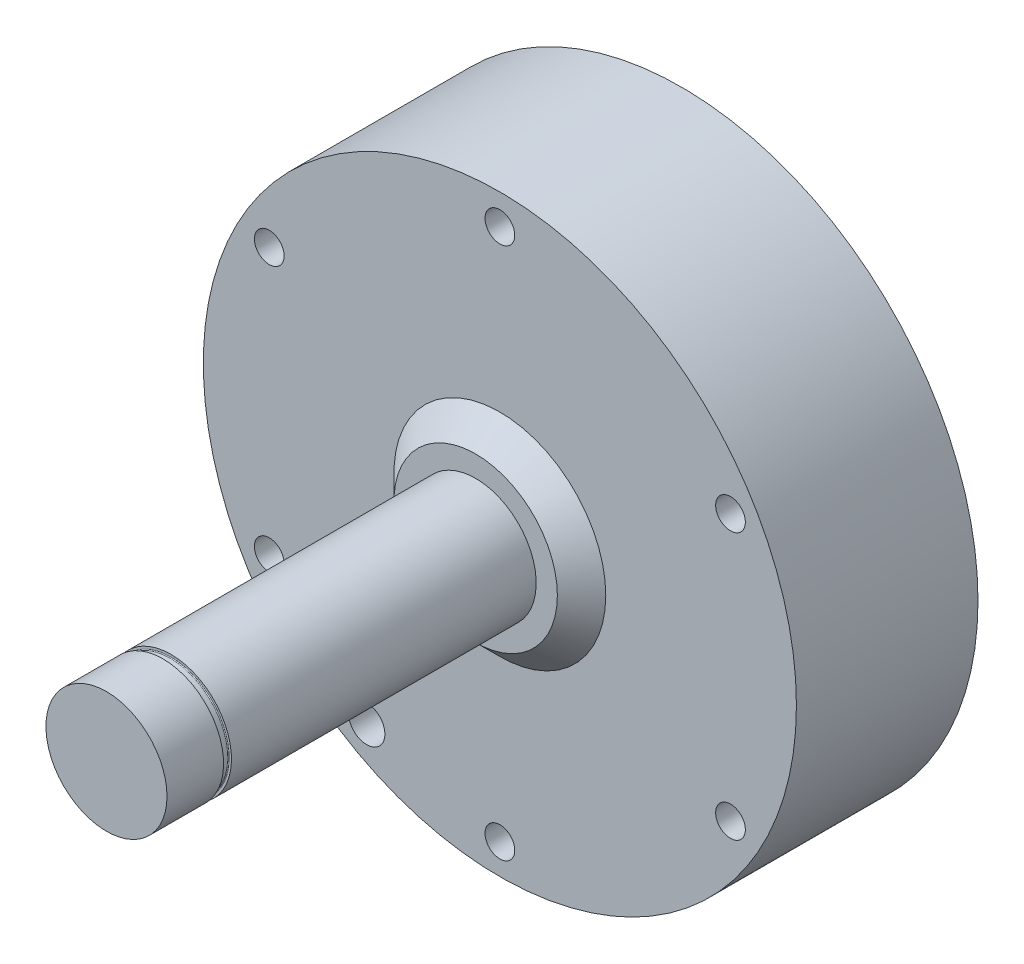
ISO-10303-21;
HEADER;
FILE_DESCRIPTION(('STEP AP214'),'2;1');
FILE_NAME('part.step','',(''),(''),'','','');
FILE_SCHEMA(('AUTOMOTIVE_DESIGN { 1 0 10303 214 1 1 1 1 }'));
ENDSEC;
DATA;
#1=APPLICATION_CONTEXT('core data for automotive mechanical design processes');
#2=APPLICATION_PROTOCOL_DEFINITION('international standard','automotive_design',2000,#1);
#3=PRODUCT_CONTEXT('',#1,'mechanical');
#4=PRODUCT('Part','Part','',(#3));
#5=PRODUCT_RELATED_PRODUCT_CATEGORY('part','',(#4));
#6=PRODUCT_DEFINITION_FORMATION('','',#4);
#7=PRODUCT_DEFINITION_CONTEXT('part definition',#1,'design');
#8=PRODUCT_DEFINITION('design','',#6,#7);
#9=PRODUCT_DEFINITION_SHAPE('','',#8);
#10=(LENGTH_UNIT() NAMED_UNIT(*) SI_UNIT(.MILLI.,.METRE.));
#11=(NAMED_UNIT(*) PLANE_ANGLE_UNIT() SI_UNIT($,.RADIAN.));
#12=(NAMED_UNIT(*) SI_UNIT($,.STERADIAN.) SOLID_ANGLE_UNIT());
#13=UNCERTAINTY_MEASURE_WITH_UNIT(LENGTH_MEASURE(1.E-05),#10,'distance_accuracy_value','');
#14=(GEOMETRIC_REPRESENTATION_CONTEXT(3) GLOBAL_UNCERTAINTY_ASSIGNED_CONTEXT((#13)) GLOBAL_UNIT_ASSIGNED_CONTEXT((#10,
#11,#12)) REPRESENTATION_CONTEXT('',''));
#15=CARTESIAN_POINT('',(0.,0.,0.));
#16=DIRECTION('',(0.,0.,1.));
#17=DIRECTION('',(1.,0.,0.));
#18=AXIS2_PLACEMENT_3D('',#15,#16,#17);
#19=CARTESIAN_POINT('',(0.,0.,95.));
#20=DIRECTION('',(0.,0.,-1.));
#21=DIRECTION('',(-1.,0.,0.));
#22=AXIS2_PLACEMENT_3D('',#19,#20,#21);
#23=CYLINDRICAL_SURFACE('',#22,10.);
#24=CARTESIAN_POINT('',(0.,0.,34.));
#25=DIRECTION('',(0.,0.,-1.));
#26=DIRECTION('',(-1.,0.,0.));
#27=AXIS2_PLACEMENT_3D('',#24,#25,#26);
#28=CIRCLE('',#27,10.);
#29=CARTESIAN_POINT('',(-10.,0.,34.));
#30=VERTEX_POINT('',#29);
#31=EDGE_CURVE('E11',#30,#30,#28,.F.);
#32=ORIENTED_EDGE('',*,*,#31,.T.);
#33=EDGE_LOOP('',(#32));
#34=FACE_BOUND('',#33,.T.);
#35=CARTESIAN_POINT('',(0.,0.,84.35));
#36=DIRECTION('',(0.,0.,-1.));
#37=DIRECTION('',(0.,1.,0.));
#38=AXIS2_PLACEMENT_3D('',#35,#36,#37);
#39=CIRCLE('',#38,10.);
#40=CARTESIAN_POINT('',(0.,10.,84.35));
#41=VERTEX_POINT('',#40);
#42=EDGE_CURVE('E101',#41,#41,#39,.T.);
#43=ORIENTED_EDGE('',*,*,#42,.T.);
#44=EDGE_LOOP('',(#43));
#45=FACE_BOUND('',#44,.T.);
#46=ADVANCED_FACE('F47',(#34,#45),#23,.T.);
#47=CARTESIAN_POINT('',(0.,0.,30.));
#48=DIRECTION('',(0.,0.,1.));
#49=DIRECTION('',(1.,0.,0.));
#50=AXIS2_PLACEMENT_3D('',#47,#48,#49);
#51=PLANE('',#50);
#52=CARTESIAN_POINT('',(38.1051177665155,21.9999999999996,30.));
#53=DIRECTION('',(0.,0.,1.));
#54=DIRECTION('',(1.,0.,0.));
#55=AXIS2_PLACEMENT_3D('',#52,#53,#54);
#56=CIRCLE('',#55,2.455);
#57=CARTESIAN_POINT('',(40.5601177665155,21.9999999999996,30.));
#58=VERTEX_POINT('',#57);
#59=EDGE_CURVE('E140',#58,#58,#56,.T.);
#60=ORIENTED_EDGE('',*,*,#59,.F.);
#61=EDGE_LOOP('',(#60));
#62=FACE_BOUND('',#61,.T.);
#63=CARTESIAN_POINT('',(-38.1051177665152,22.0000000000002,30.));
#64=DIRECTION('',(0.,0.,1.));
#65=DIRECTION('',(1.,0.,0.));
#66=AXIS2_PLACEMENT_3D('',#63,#64,#65);
#67=CIRCLE('',#66,2.455);
#68=CARTESIAN_POINT('',(-35.6501177665152,22.0000000000002,30.));
#69=VERTEX_POINT('',#68);
#70=EDGE_CURVE('E152',#69,#69,#67,.T.);
#71=ORIENTED_EDGE('',*,*,#70,.F.);
#72=EDGE_LOOP('',(#71));
#73=FACE_BOUND('',#72,.T.);
#74=CARTESIAN_POINT('',(0.,-44.,30.));
#75=DIRECTION('',(0.,0.,1.));
#76=DIRECTION('',(1.,0.,0.));
#77=AXIS2_PLACEMENT_3D('',#74,#75,#76);
#78=CIRCLE('',#77,2.455);
#79=CARTESIAN_POINT('',(2.45499999999999,-44.,30.));
#80=VERTEX_POINT('',#79);
#81=EDGE_CURVE('E164',#80,#80,#78,.T.);
#82=ORIENTED_EDGE('',*,*,#81,.F.);
#83=EDGE_LOOP('',(#82));
#84=FACE_BOUND('',#83,.T.);
#85=CARTESIAN_POINT('',(-22.,-38.1051177665153,30.));
#86=DIRECTION('',(0.,0.,1.));
#87=DIRECTION('',(1.,0.,0.));
#88=AXIS2_PLACEMENT_3D('',#85,#86,#87);
#89=CIRCLE('',#88,3.);
#90=CARTESIAN_POINT('',(-19.0000000000001,-38.1051177665153,30.));
#91=VERTEX_POINT('',#90);
#92=EDGE_CURVE('E170',#91,#91,#89,.T.);
#93=ORIENTED_EDGE('',*,*,#92,.F.);
#94=EDGE_LOOP('',(#93));
#95=FACE_BOUND('',#94,.T.);
#96=CARTESIAN_POINT('',(0.,0.,30.));
#97=DIRECTION('',(0.,0.,1.));
#98=DIRECTION('',(1.,0.,0.));
#99=AXIS2_PLACEMENT_3D('',#96,#97,#98);
#100=CIRCLE('',#99,49.);
#101=CARTESIAN_POINT('',(49.,0.,30.));
#102=VERTEX_POINT('',#101);
#103=EDGE_CURVE('E189',#102,#102,#100,.T.);
#104=ORIENTED_EDGE('',*,*,#103,.T.);
#105=EDGE_LOOP('',(#104));
#106=FACE_BOUND('',#105,.T.);
#107=CARTESIAN_POINT('',(0.,0.,30.));
#108=DIRECTION('',(0.,0.,1.));
#109=DIRECTION('',(1.,0.,0.));
#110=AXIS2_PLACEMENT_3D('',#107,#108,#109);
#111=CIRCLE('',#110,17.5);
#112=CARTESIAN_POINT('',(17.5,0.,30.));
#113=VERTEX_POINT('',#112);
#114=EDGE_CURVE('E185',#113,#113,#111,.T.);
#115=ORIENTED_EDGE('',*,*,#114,.F.);
#116=EDGE_LOOP('',(#115));
#117=FACE_BOUND('',#116,.T.);
#118=CARTESIAN_POINT('',(-38.1051177665154,-21.9999999999999,30.));
#119=DIRECTION('',(0.,0.,1.));
#120=DIRECTION('',(1.,0.,0.));
#121=AXIS2_PLACEMENT_3D('',#118,#119,#120);
#122=CIRCLE('',#121,2.455);
#123=CARTESIAN_POINT('',(-35.6501177665154,-21.9999999999999,30.));
#124=VERTEX_POINT('',#123);
#125=EDGE_CURVE('E158',#124,#124,#122,.T.);
#126=ORIENTED_EDGE('',*,*,#125,.F.);
#127=EDGE_LOOP('',(#126));
#128=FACE_BOUND('',#127,.T.);
#129=CARTESIAN_POINT('',(3.14577829780722E-13,44.,30.));
#130=DIRECTION('',(0.,0.,1.));
#131=DIRECTION('',(1.,0.,0.));
#132=AXIS2_PLACEMENT_3D('',#129,#130,#131);
#133=CIRCLE('',#132,2.455);
#134=CARTESIAN_POINT('',(2.45500000000031,44.,30.));
#135=VERTEX_POINT('',#134);
#136=EDGE_CURVE('E146',#135,#135,#133,.T.);
#137=ORIENTED_EDGE('',*,*,#136,.F.);
#138=EDGE_LOOP('',(#137));
#139=FACE_BOUND('',#138,.T.);
#140=CARTESIAN_POINT('',(38.105117766515,-22.0000000000005,30.));
#141=DIRECTION('',(0.,0.,1.));
#142=DIRECTION('',(1.,0.,0.));
#143=AXIS2_PLACEMENT_3D('',#140,#141,#142);
#144=CIRCLE('',#143,2.455);
#145=CARTESIAN_POINT('',(40.560117766515,-22.0000000000005,30.));
#146=VERTEX_POINT('',#145);
#147=EDGE_CURVE('E134',#146,#146,#144,.T.);
#148=ORIENTED_EDGE('',*,*,#147,.F.);
#149=EDGE_LOOP('',(#148));
#150=FACE_BOUND('',#149,.T.);
#151=ADVANCED_FACE('F215',(#62,#73,#84,#95,#106,#117,#128,#139,#150),#51,.T.);
#152=CARTESIAN_POINT('',(0.,0.,30.));
#153=DIRECTION('',(0.,0.,-1.));
#154=DIRECTION('',(-1.,0.,0.));
#155=AXIS2_PLACEMENT_3D('',#152,#153,#154);
#156=CYLINDRICAL_SURFACE('',#155,49.);
#157=CARTESIAN_POINT('',(-49.,0.,21.));
#158=CARTESIAN_POINT('',(-48.9999987782611,-0.168342132239242,20.9999925903546));
#159=CARTESIAN_POINT('',(-48.9991231981665,-0.336802306195177,20.9857828521781));
#160=CARTESIAN_POINT('',(-48.9957145124218,-0.669071574623784,20.9293010732423));
#161=CARTESIAN_POINT('',(-48.9931794749463,-0.832875015867812,20.886996325384));
#162=CARTESIAN_POINT('',(-48.9867386712462,-1.1509697533479,20.775543736485));
#163=CARTESIAN_POINT('',(-48.9828336254435,-1.3052659989282,20.706410001503));
#164=CARTESIAN_POINT('',(-48.9740920800564,-1.60002336933338,20.5432846263633));
#165=CARTESIAN_POINT('',(-48.9692557945962,-1.74048766340163,20.4492986987323));
#166=CARTESIAN_POINT('',(-48.9591876344111,-2.00383706595997,20.2389880206162));
#167=CARTESIAN_POINT('',(-48.9539552645477,-2.12669959703624,20.1226350202509));
#168=CARTESIAN_POINT('',(-48.943688885261,-2.35116484417934,19.8709510932809));
#169=CARTESIAN_POINT('',(-48.9386548841123,-2.45276667414156,19.7356193760727));
#170=CARTESIAN_POINT('',(-48.9293491416637,-2.63189536608893,19.4496925321437));
#171=CARTESIAN_POINT('',(-48.9250779923096,-2.7094035665099,19.2990856933228));
#172=CARTESIAN_POINT('',(-48.9177859887818,-2.83802538849686,18.9869659222724));
#173=CARTESIAN_POINT('',(-48.9147651216073,-2.88913928451839,18.8254531034661));
#174=CARTESIAN_POINT('',(-48.9103190415616,-2.96345914981416,18.4963228276852));
#175=CARTESIAN_POINT('',(-48.908891814127,-2.98670035647312,18.3287133552047));
#176=CARTESIAN_POINT('',(-48.9077879273528,-3.00472388165541,17.9919665455956));
#177=CARTESIAN_POINT('',(-48.9081112488621,-2.99950651151652,17.8228292252021));
#178=CARTESIAN_POINT('',(-48.9104701284996,-2.96079023817325,17.4880679480226));
#179=CARTESIAN_POINT('',(-48.9125033784114,-2.92732946025551,17.3224395633948));
#180=CARTESIAN_POINT('',(-48.9180493413292,-2.83313532919725,16.9991548213024));
#181=CARTESIAN_POINT('',(-48.9215620629073,-2.77240181803547,16.8414985100349));
#182=CARTESIAN_POINT('',(-48.9296737585873,-2.62534291212242,16.5385106805562));
#183=CARTESIAN_POINT('',(-48.9342734667511,-2.53900021292164,16.3931875817226));
#184=CARTESIAN_POINT('',(-48.9440400332174,-2.34318643121859,16.1190834190871));
#185=CARTESIAN_POINT('',(-48.9492068976297,-2.23371509955261,15.9903025335176));
#186=CARTESIAN_POINT('',(-48.9595357461034,-1.99453676722566,15.7527165848546));
#187=CARTESIAN_POINT('',(-48.9646977081483,-1.86479676908493,15.643944736669));
#188=CARTESIAN_POINT('',(-48.9744268496561,-1.58887965822355,15.4497206706382));
#189=CARTESIAN_POINT('',(-48.9789940289189,-1.44270253997375,15.3642684606375));
#190=CARTESIAN_POINT('',(-48.9870192872341,-1.13804055781479,15.2191122003982));
#191=CARTESIAN_POINT('',(-48.9904773125742,-0.979555098318889,15.1594093970617));
#192=CARTESIAN_POINT('',(-48.9958938572066,-0.654784212144267,15.067468828864));
#193=CARTESIAN_POINT('',(-48.9978523933052,-0.488498872909138,15.0352307561763));
#194=CARTESIAN_POINT('',(-49.0000470940588,-0.153136661949562,14.999175902475));
#195=CARTESIAN_POINT('',(-49.0002860418123,0.0159352549807618,14.9953131966331));
#196=CARTESIAN_POINT('',(-48.9990220406461,0.352324652623047,15.0159987466675));
#197=CARTESIAN_POINT('',(-48.9975191004198,0.519642142086703,15.0405468607525));
#198=CARTESIAN_POINT('',(-48.9929423179814,0.847643855794574,15.1173191955916));
#199=CARTESIAN_POINT('',(-48.9898696711438,1.0083330271957,15.1695223573864));
#200=CARTESIAN_POINT('',(-48.9824991874776,1.31866938728175,15.30010154663));
#201=CARTESIAN_POINT('',(-48.9782013400714,1.4683164806224,15.3784778000414));
#202=CARTESIAN_POINT('',(-48.9688565067312,1.75253112004625,15.5592953401906));
#203=CARTESIAN_POINT('',(-48.9638085686364,1.88707911273342,15.6617673116271));
#204=CARTESIAN_POINT('',(-48.9535348807093,2.13707941317929,15.8878228018194));
#205=CARTESIAN_POINT('',(-48.9483091291954,2.25253154028778,16.0114065202734));
#206=CARTESIAN_POINT('',(-48.9382607488204,2.46121830716684,16.2763754871246));
#207=CARTESIAN_POINT('',(-48.9334386659401,2.55442316192653,16.417784217407));
#208=CARTESIAN_POINT('',(-48.9247500925023,2.71576591909967,16.71427103936));
#209=CARTESIAN_POINT('',(-48.9208835962452,2.78390397102339,16.8693490494938));
#210=CARTESIAN_POINT('',(-48.9145461606989,2.89312731704894,17.1886633685796));
#211=CARTESIAN_POINT('',(-48.9120742531065,2.93423138492115,17.352893235863));
#212=CARTESIAN_POINT('',(-48.9088020649113,2.98828129316026,17.6859389442547));
#213=CARTESIAN_POINT('',(-48.9080017685169,3.00122739953276,17.8547547420247));
#214=CARTESIAN_POINT('',(-48.9081634349173,2.99859133925077,18.191884052363));
#215=CARTESIAN_POINT('',(-48.9091225049361,2.98305600222657,18.3601979344897));
#216=CARTESIAN_POINT('',(-48.9126886992029,2.92399510479369,18.691822606684));
#217=CARTESIAN_POINT('',(-48.9152958264563,2.88046949334117,18.8551333876272));
#218=CARTESIAN_POINT('',(-48.9218636280755,2.76667402075177,19.1721234119009));
#219=CARTESIAN_POINT('',(-48.925824295324,2.69640430024134,19.325802705871));
#220=CARTESIAN_POINT('',(-48.9346527620099,2.53112189857519,19.619187929208));
#221=CARTESIAN_POINT('',(-48.9395205374642,2.43610987155502,19.758894227857));
#222=CARTESIAN_POINT('',(-48.94962397496,2.22386722657035,20.0206048811718));
#223=CARTESIAN_POINT('',(-48.9548601881662,2.10660285562631,20.1425818405755));
#224=CARTESIAN_POINT('',(-48.9651058168507,1.85322764074876,20.3651606586719));
#225=CARTESIAN_POINT('',(-48.9701151764916,1.71711218994053,20.4657572771047));
#226=CARTESIAN_POINT('',(-48.9793476296826,1.42974910005197,20.6427908622421));
#227=CARTESIAN_POINT('',(-48.9835697680307,1.27848341547059,20.7191985558979));
#228=CARTESIAN_POINT('',(-48.9907390581765,0.965354874405892,20.8454388842453));
#229=CARTESIAN_POINT('',(-48.9936877038608,0.803504692350495,20.8953026726621));
#230=CARTESIAN_POINT('',(-48.9972042527984,0.533885495324568,20.9540663865922));
#231=CARTESIAN_POINT('',(-48.9982480044745,0.427859687374557,20.9712692498115));
#232=CARTESIAN_POINT('',(-48.9996462670196,0.214571907055574,20.9942384106042));
#233=CARTESIAN_POINT('',(-49.0000007787992,0.107309936320186,21.0000047232892));
#234=CARTESIAN_POINT('',(-49.,0.,21.));
#235=B_SPLINE_CURVE_WITH_KNOTS('',3,(#157,#158,#159,#160,#161,#162,#163,#164,#165,#166,#167,
#168,#169,#170,#171,#172,#173,#174,#175,#176,#177,#178,#179,#180,#181,#182,#183,#184,#185,#186,
#187,#188,#189,#190,#191,#192,#193,#194,#195,#196,#197,#198,#199,#200,#201,#202,#203,#204,#205,
#206,#207,#208,#209,#210,#211,#212,#213,#214,#215,#216,#217,#218,#219,#220,#221,#222,#223,#224,
#225,#226,#227,#228,#229,#230,#231,#232,#233,#234),.UNSPECIFIED.,.T.,.F.,(4,2,2,2,2,2,2,2,2,2,2,
2,2,2,2,2,2,2,2,2,2,2,2,2,2,2,2,2,2,2,2,2,2,2,2,2,2,2,4),(0.,0.504634654396564,1.00985781674203,
1.51481570358409,2.01965762151657,2.52514140060477,3.03064624307793,3.53654165104006,
4.04243179845081,4.54768170979437,5.05292609369829,5.55748954567153,6.0620559211797,
6.56696401827817,7.07187755500635,7.57762182785094,8.08336627081969,8.58913520145787,
9.09489846333091,9.59984297917681,10.104784974984,10.6093430155595,11.1139054122984,
11.619113857539,12.1243270818661,12.6302129469633,13.1360957946689,13.6416269596658,
14.1471533489368,14.6518492892306,15.1565461499046,15.6612403568073,16.1659212219903,
16.6713738104314,17.1769501413444,17.6831359942207,18.1887264358806,18.5104069531811,
18.8320870454309),.UNSPECIFIED.);
#236=CARTESIAN_POINT('',(-49.,0.,21.));
#237=VERTEX_POINT('',#236);
#238=EDGE_CURVE('E56',#237,#237,#235,.T.);
#239=ORIENTED_EDGE('',*,*,#238,.T.);
#240=EDGE_LOOP('',(#239));
#241=FACE_BOUND('',#240,.T.);
#242=ORIENTED_EDGE('',*,*,#103,.F.);
#243=EDGE_LOOP('',(#242));
#244=FACE_BOUND('',#243,.T.);
#245=CARTESIAN_POINT('',(0.,0.,0.));
#246=DIRECTION('',(0.,0.,1.));
#247=DIRECTION('',(1.,0.,0.));
#248=AXIS2_PLACEMENT_3D('',#245,#246,#247);
#249=CIRCLE('',#248,49.);
#250=CARTESIAN_POINT('',(49.,0.,0.));
#251=VERTEX_POINT('',#250);
#252=EDGE_CURVE('E188',#251,#251,#249,.T.);
#253=ORIENTED_EDGE('',*,*,#252,.T.);
#254=EDGE_LOOP('',(#253));
#255=FACE_BOUND('',#254,.T.);
#256=ADVANCED_FACE('F49',(#241,#244,#255),#156,.T.);
#257=CARTESIAN_POINT('',(0.,0.,0.));
#258=DIRECTION('',(0.,0.,1.));
#259=DIRECTION('',(1.,0.,0.));
#260=AXIS2_PLACEMENT_3D('',#257,#258,#259);
#261=PLANE('',#260);
#262=CARTESIAN_POINT('',(15.0439813274521,-25.9553694822894,0.));
#263=DIRECTION('',(0.,0.,-1.));
#264=DIRECTION('',(-1.,0.,0.));
#265=AXIS2_PLACEMENT_3D('',#262,#263,#264);
#266=CIRCLE('',#265,2.5);
#267=CARTESIAN_POINT('',(12.5439813274521,-25.9553694822894,0.));
#268=VERTEX_POINT('',#267);
#269=EDGE_CURVE('E100',#268,#268,#266,.T.);
#270=ORIENTED_EDGE('',*,*,#269,.F.);
#271=EDGE_LOOP('',(#270));
#272=FACE_BOUND('',#271,.T.);
#273=CARTESIAN_POINT('',(14.9560186725478,26.006154744777,0.));
#274=DIRECTION('',(0.,0.,-1.));
#275=DIRECTION('',(-1.,0.,0.));
#276=AXIS2_PLACEMENT_3D('',#273,#274,#275);
#277=CIRCLE('',#276,2.5);
#278=CARTESIAN_POINT('',(12.4560186725478,26.006154744777,0.));
#279=VERTEX_POINT('',#278);
#280=EDGE_CURVE('E113',#279,#279,#277,.T.);
#281=ORIENTED_EDGE('',*,*,#280,.F.);
#282=EDGE_LOOP('',(#281));
#283=FACE_BOUND('',#282,.T.);
#284=CARTESIAN_POINT('',(-30.,-0.0507852624878061,0.));
#285=DIRECTION('',(0.,0.,-1.));
#286=DIRECTION('',(-1.,0.,0.));
#287=AXIS2_PLACEMENT_3D('',#284,#285,#286);
#288=CIRCLE('',#287,2.5);
#289=CARTESIAN_POINT('',(-32.5,-0.0507852624878061,0.));
#290=VERTEX_POINT('',#289);
#291=EDGE_CURVE('E119',#290,#290,#288,.T.);
#292=ORIENTED_EDGE('',*,*,#291,.F.);
#293=EDGE_LOOP('',(#292));
#294=FACE_BOUND('',#293,.T.);
#295=CARTESIAN_POINT('',(29.9999722931035,0.0407726994683093,0.));
#296=DIRECTION('',(0.,0.,-1.));
#297=DIRECTION('',(0.707106781186551,0.707106781186544,0.));
#298=AXIS2_PLACEMENT_3D('',#295,#296,#297);
#299=CIRCLE('',#298,3.);
#300=CARTESIAN_POINT('',(32.1212926366632,2.16209304302794,0.));
#301=VERTEX_POINT('',#300);
#302=EDGE_CURVE('E122',#301,#301,#299,.T.);
#303=ORIENTED_EDGE('',*,*,#302,.F.);
#304=EDGE_LOOP('',(#303));
#305=FACE_BOUND('',#304,.T.);
#306=CARTESIAN_POINT('',(-21.2420144961435,21.1843531915806,0.));
#307=DIRECTION('',(0.,0.,-1.));
#308=DIRECTION('',(-1.,0.,0.));
#309=AXIS2_PLACEMENT_3D('',#306,#307,#308);
#310=CIRCLE('',#309,3.);
#311=CARTESIAN_POINT('',(-24.2420144961435,21.1843531915806,0.));
#312=VERTEX_POINT('',#311);
#313=EDGE_CURVE('E131',#312,#312,#310,.T.);
#314=ORIENTED_EDGE('',*,*,#313,.F.);
#315=EDGE_LOOP('',(#314));
#316=FACE_BOUND('',#315,.T.);
#317=CARTESIAN_POINT('',(-22.,-38.1051177665153,0.));
#318=DIRECTION('',(0.,0.,1.));
#319=DIRECTION('',(1.,0.,0.));
#320=AXIS2_PLACEMENT_3D('',#317,#318,#319);
#321=CIRCLE('',#320,3.);
#322=CARTESIAN_POINT('',(-19.0000000000001,-38.1051177665153,0.));
#323=VERTEX_POINT('',#322);
#324=EDGE_CURVE('E171',#323,#323,#321,.T.);
#325=ORIENTED_EDGE('',*,*,#324,.T.);
#326=EDGE_LOOP('',(#325));
#327=FACE_BOUND('',#326,.T.);
#328=ORIENTED_EDGE('',*,*,#252,.F.);
#329=EDGE_LOOP('',(#328));
#330=FACE_BOUND('',#329,.T.);
#331=ADVANCED_FACE('F213',(#272,#283,#294,#305,#316,#327,#330),#261,.F.);
#332=CARTESIAN_POINT('',(0.,0.,30.));
#333=DIRECTION('',(0.,0.,-1.));
#334=DIRECTION('',(-1.,0.,0.));
#335=AXIS2_PLACEMENT_3D('',#332,#333,#334);
#336=CONICAL_SURFACE('',#335,17.5,0.785398163397446);
#337=CARTESIAN_POINT('',(0.,0.,34.));
#338=DIRECTION('',(0.,0.,1.));
#339=DIRECTION('',(1.,0.,0.));
#340=AXIS2_PLACEMENT_3D('',#337,#338,#339);
#341=CIRCLE('',#340,13.5);
#342=CARTESIAN_POINT('',(13.5,0.,34.));
#343=VERTEX_POINT('',#342);
#344=EDGE_CURVE('E182',#343,#343,#341,.T.);
#345=ORIENTED_EDGE('',*,*,#344,.F.);
#346=EDGE_LOOP('',(#345));
#347=FACE_BOUND('',#346,.T.);
#348=ORIENTED_EDGE('',*,*,#114,.T.);
#349=EDGE_LOOP('',(#348));
#350=FACE_BOUND('',#349,.T.);
#351=ADVANCED_FACE('F209',(#347,#350),#336,.T.);
#352=CARTESIAN_POINT('',(0.,13.5,34.));
#353=DIRECTION('',(0.,0.,-1.));
#354=DIRECTION('',(-1.,0.,0.));
#355=AXIS2_PLACEMENT_3D('',#352,#353,#354);
#356=PLANE('',#355);
#357=ORIENTED_EDGE('',*,*,#31,.F.);
#358=EDGE_LOOP('',(#357));
#359=FACE_BOUND('',#358,.T.);
#360=ORIENTED_EDGE('',*,*,#344,.T.);
#361=EDGE_LOOP('',(#360));
#362=FACE_BOUND('',#361,.T.);
#363=ADVANCED_FACE('F204',(#359,#362),#356,.F.);
#364=CARTESIAN_POINT('',(-37.,0.,18.));
#365=DIRECTION('',(-1.,0.,0.));
#366=DIRECTION('',(0.,0.,1.));
#367=AXIS2_PLACEMENT_3D('',#364,#365,#366);
#368=CYLINDRICAL_SURFACE('',#367,3.);
#369=CARTESIAN_POINT('',(-37.,0.,18.));
#370=DIRECTION('',(-1.,0.,0.));
#371=DIRECTION('',(0.,0.,1.));
#372=AXIS2_PLACEMENT_3D('',#369,#370,#371);
#373=CIRCLE('',#372,3.);
#374=CARTESIAN_POINT('',(-37.,0.,21.));
#375=VERTEX_POINT('',#374);
#376=EDGE_CURVE('E179',#375,#375,#373,.T.);
#377=ORIENTED_EDGE('',*,*,#376,.F.);
#378=EDGE_LOOP('',(#377));
#379=FACE_BOUND('',#378,.T.);
#380=ORIENTED_EDGE('',*,*,#238,.F.);
#381=EDGE_LOOP('',(#380));
#382=FACE_BOUND('',#381,.T.);
#383=ADVANCED_FACE('F198',(#379,#382),#368,.F.);
#384=CARTESIAN_POINT('',(-37.,0.,18.));
#385=DIRECTION('',(-1.,0.,0.));
#386=DIRECTION('',(0.,0.,1.));
#387=AXIS2_PLACEMENT_3D('',#384,#385,#386);
#388=PLANE('',#387);
#389=ORIENTED_EDGE('',*,*,#376,.T.);
#390=EDGE_LOOP('',(#389));
#391=FACE_BOUND('',#390,.T.);
#392=ADVANCED_FACE('F203',(#391),#388,.T.);
#393=CARTESIAN_POINT('',(-22.,-38.1051177665153,0.));
#394=DIRECTION('',(0.,0.,1.));
#395=DIRECTION('',(1.,0.,0.));
#396=AXIS2_PLACEMENT_3D('',#393,#394,#395);
#397=CYLINDRICAL_SURFACE('',#396,3.);
#398=ORIENTED_EDGE('',*,*,#324,.F.);
#399=EDGE_LOOP('',(#398));
#400=FACE_BOUND('',#399,.T.);
#401=ORIENTED_EDGE('',*,*,#92,.T.);
#402=EDGE_LOOP('',(#401));
#403=FACE_BOUND('',#402,.T.);
#404=ADVANCED_FACE('F360',(#400,#403),#397,.F.);
#405=CARTESIAN_POINT('',(0.,-44.,3.52488718028734));
#406=DIRECTION('',(0.,0.,1.));
#407=DIRECTION('',(1.,0.,0.));
#408=AXIS2_PLACEMENT_3D('',#405,#406,#407);
#409=CONICAL_SURFACE('',#408,0.,1.02974425867666);
#410=CARTESIAN_POINT('',(0.,-44.,5.));
#411=DIRECTION('',(0.,0.,1.));
#412=DIRECTION('',(1.,0.,0.));
#413=AXIS2_PLACEMENT_3D('',#410,#411,#412);
#414=CIRCLE('',#413,2.455);
#415=CARTESIAN_POINT('',(2.45499999999999,-44.,5.));
#416=VERTEX_POINT('',#415);
#417=EDGE_CURVE('E167',#416,#416,#414,.T.);
#418=ORIENTED_EDGE('',*,*,#417,.T.);
#419=EDGE_LOOP('',(#418));
#420=FACE_BOUND('',#419,.T.);
#421=CARTESIAN_POINT('',(0.,-44.,3.52488718028734));
#422=VERTEX_POINT('',#421);
#423=VERTEX_LOOP('',#422);
#424=FACE_BOUND('',#423,.T.);
#425=ADVANCED_FACE('F356',(#420,#424),#409,.F.);
#426=CARTESIAN_POINT('',(0.,-44.,30.));
#427=DIRECTION('',(0.,0.,1.));
#428=DIRECTION('',(1.,0.,0.));
#429=AXIS2_PLACEMENT_3D('',#426,#427,#428);
#430=CYLINDRICAL_SURFACE('',#429,2.455);
#431=ORIENTED_EDGE('',*,*,#81,.T.);
#432=EDGE_LOOP('',(#431));
#433=FACE_BOUND('',#432,.T.);
#434=ORIENTED_EDGE('',*,*,#417,.F.);
#435=EDGE_LOOP('',(#434));
#436=FACE_BOUND('',#435,.T.);
#437=ADVANCED_FACE('F352',(#433,#436),#430,.F.);
#438=CARTESIAN_POINT('',(-38.1051177665154,-21.9999999999999,3.52488718028734));
#439=DIRECTION('',(0.,0.,1.));
#440=DIRECTION('',(1.,0.,0.));
#441=AXIS2_PLACEMENT_3D('',#438,#439,#440);
#442=CONICAL_SURFACE('',#441,0.,1.02974425867666);
#443=CARTESIAN_POINT('',(-38.1051177665154,-21.9999999999999,5.));
#444=DIRECTION('',(0.,0.,1.));
#445=DIRECTION('',(1.,0.,0.));
#446=AXIS2_PLACEMENT_3D('',#443,#444,#445);
#447=CIRCLE('',#446,2.455);
#448=CARTESIAN_POINT('',(-35.6501177665154,-21.9999999999999,5.));
#449=VERTEX_POINT('',#448);
#450=EDGE_CURVE('E161',#449,#449,#447,.T.);
#451=ORIENTED_EDGE('',*,*,#450,.T.);
#452=EDGE_LOOP('',(#451));
#453=FACE_BOUND('',#452,.T.);
#454=CARTESIAN_POINT('',(-38.1051177665154,-21.9999999999999,3.52488718028734));
#455=VERTEX_POINT('',#454);
#456=VERTEX_LOOP('',#455);
#457=FACE_BOUND('',#456,.T.);
#458=ADVANCED_FACE('F348',(#453,#457),#442,.F.);
#459=CARTESIAN_POINT('',(-38.1051177665154,-21.9999999999999,30.));
#460=DIRECTION('',(0.,0.,1.));
#461=DIRECTION('',(1.,0.,0.));
#462=AXIS2_PLACEMENT_3D('',#459,#460,#461);
#463=CYLINDRICAL_SURFACE('',#462,2.455);
#464=ORIENTED_EDGE('',*,*,#125,.T.);
#465=EDGE_LOOP('',(#464));
#466=FACE_BOUND('',#465,.T.);
#467=ORIENTED_EDGE('',*,*,#450,.F.);
#468=EDGE_LOOP('',(#467));
#469=FACE_BOUND('',#468,.T.);
#470=ADVANCED_FACE('F344',(#466,#469),#463,.F.);
#471=CARTESIAN_POINT('',(-38.1051177665152,22.0000000000002,3.52488718028734));
#472=DIRECTION('',(0.,0.,1.));
#473=DIRECTION('',(1.,0.,0.));
#474=AXIS2_PLACEMENT_3D('',#471,#472,#473);
#475=CONICAL_SURFACE('',#474,0.,1.02974425867666);
#476=CARTESIAN_POINT('',(-38.1051177665152,22.0000000000002,5.));
#477=DIRECTION('',(0.,0.,1.));
#478=DIRECTION('',(1.,0.,0.));
#479=AXIS2_PLACEMENT_3D('',#476,#477,#478);
#480=CIRCLE('',#479,2.455);
#481=CARTESIAN_POINT('',(-35.6501177665152,22.0000000000002,5.));
#482=VERTEX_POINT('',#481);
#483=EDGE_CURVE('E155',#482,#482,#480,.T.);
#484=ORIENTED_EDGE('',*,*,#483,.T.);
#485=EDGE_LOOP('',(#484));
#486=FACE_BOUND('',#485,.T.);
#487=CARTESIAN_POINT('',(-38.1051177665152,22.0000000000002,3.52488718028734));
#488=VERTEX_POINT('',#487);
#489=VERTEX_LOOP('',#488);
#490=FACE_BOUND('',#489,.T.);
#491=ADVANCED_FACE('F340',(#486,#490),#475,.F.);
#492=CARTESIAN_POINT('',(-38.1051177665152,22.0000000000002,30.));
#493=DIRECTION('',(0.,0.,1.));
#494=DIRECTION('',(1.,0.,0.));
#495=AXIS2_PLACEMENT_3D('',#492,#493,#494);
#496=CYLINDRICAL_SURFACE('',#495,2.455);
#497=ORIENTED_EDGE('',*,*,#70,.T.);
#498=EDGE_LOOP('',(#497));
#499=FACE_BOUND('',#498,.T.);
#500=ORIENTED_EDGE('',*,*,#483,.F.);
#501=EDGE_LOOP('',(#500));
#502=FACE_BOUND('',#501,.T.);
#503=ADVANCED_FACE('F336',(#499,#502),#496,.F.);
#504=CARTESIAN_POINT('',(3.14577829780722E-13,44.,3.52488718028734));
#505=DIRECTION('',(0.,0.,1.));
#506=DIRECTION('',(1.,0.,0.));
#507=AXIS2_PLACEMENT_3D('',#504,#505,#506);
#508=CONICAL_SURFACE('',#507,0.,1.02974425867666);
#509=CARTESIAN_POINT('',(3.14577829780722E-13,44.,5.));
#510=DIRECTION('',(0.,0.,1.));
#511=DIRECTION('',(1.,0.,0.));
#512=AXIS2_PLACEMENT_3D('',#509,#510,#511);
#513=CIRCLE('',#512,2.455);
#514=CARTESIAN_POINT('',(2.45500000000031,44.,5.));
#515=VERTEX_POINT('',#514);
#516=EDGE_CURVE('E149',#515,#515,#513,.T.);
#517=ORIENTED_EDGE('',*,*,#516,.T.);
#518=EDGE_LOOP('',(#517));
#519=FACE_BOUND('',#518,.T.);
#520=CARTESIAN_POINT('',(3.14571053517144E-13,44.,3.52488718028734));
#521=VERTEX_POINT('',#520);
#522=VERTEX_LOOP('',#521);
#523=FACE_BOUND('',#522,.T.);
#524=ADVANCED_FACE('F332',(#519,#523),#508,.F.);
#525=CARTESIAN_POINT('',(3.14577829780722E-13,44.,30.));
#526=DIRECTION('',(0.,0.,1.));
#527=DIRECTION('',(1.,0.,0.));
#528=AXIS2_PLACEMENT_3D('',#525,#526,#527);
#529=CYLINDRICAL_SURFACE('',#528,2.455);
#530=ORIENTED_EDGE('',*,*,#136,.T.);
#531=EDGE_LOOP('',(#530));
#532=FACE_BOUND('',#531,.T.);
#533=ORIENTED_EDGE('',*,*,#516,.F.);
#534=EDGE_LOOP('',(#533));
#535=FACE_BOUND('',#534,.T.);
#536=ADVANCED_FACE('F328',(#532,#535),#529,.F.);
#537=CARTESIAN_POINT('',(38.1051177665155,21.9999999999996,3.52488718028734));
#538=DIRECTION('',(0.,0.,1.));
#539=DIRECTION('',(1.,0.,0.));
#540=AXIS2_PLACEMENT_3D('',#537,#538,#539);
#541=CONICAL_SURFACE('',#540,0.,1.02974425867666);
#542=CARTESIAN_POINT('',(38.1051177665155,21.9999999999996,5.));
#543=DIRECTION('',(0.,0.,1.));
#544=DIRECTION('',(1.,0.,0.));
#545=AXIS2_PLACEMENT_3D('',#542,#543,#544);
#546=CIRCLE('',#545,2.455);
#547=CARTESIAN_POINT('',(40.5601177665155,21.9999999999996,5.));
#548=VERTEX_POINT('',#547);
#549=EDGE_CURVE('E143',#548,#548,#546,.T.);
#550=ORIENTED_EDGE('',*,*,#549,.T.);
#551=EDGE_LOOP('',(#550));
#552=FACE_BOUND('',#551,.T.);
#553=CARTESIAN_POINT('',(38.1051177665155,21.9999999999996,3.52488718028734));
#554=VERTEX_POINT('',#553);
#555=VERTEX_LOOP('',#554);
#556=FACE_BOUND('',#555,.T.);
#557=ADVANCED_FACE('F324',(#552,#556),#541,.F.);
#558=CARTESIAN_POINT('',(38.1051177665155,21.9999999999996,30.));
#559=DIRECTION('',(0.,0.,1.));
#560=DIRECTION('',(1.,0.,0.));
#561=AXIS2_PLACEMENT_3D('',#558,#559,#560);
#562=CYLINDRICAL_SURFACE('',#561,2.455);
#563=ORIENTED_EDGE('',*,*,#59,.T.);
#564=EDGE_LOOP('',(#563));
#565=FACE_BOUND('',#564,.T.);
#566=ORIENTED_EDGE('',*,*,#549,.F.);
#567=EDGE_LOOP('',(#566));
#568=FACE_BOUND('',#567,.T.);
#569=ADVANCED_FACE('F320',(#565,#568),#562,.F.);
#570=CARTESIAN_POINT('',(38.105117766515,-22.0000000000005,3.52488718028734));
#571=DIRECTION('',(0.,0.,1.));
#572=DIRECTION('',(1.,0.,0.));
#573=AXIS2_PLACEMENT_3D('',#570,#571,#572);
#574=CONICAL_SURFACE('',#573,0.,1.02974425867666);
#575=CARTESIAN_POINT('',(38.105117766515,-22.0000000000005,5.));
#576=DIRECTION('',(0.,0.,1.));
#577=DIRECTION('',(1.,0.,0.));
#578=AXIS2_PLACEMENT_3D('',#575,#576,#577);
#579=CIRCLE('',#578,2.455);
#580=CARTESIAN_POINT('',(40.560117766515,-22.0000000000005,5.));
#581=VERTEX_POINT('',#580);
#582=EDGE_CURVE('E137',#581,#581,#579,.T.);
#583=ORIENTED_EDGE('',*,*,#582,.T.);
#584=EDGE_LOOP('',(#583));
#585=FACE_BOUND('',#584,.T.);
#586=CARTESIAN_POINT('',(38.105117766515,-22.0000000000005,3.52488718028734));
#587=VERTEX_POINT('',#586);
#588=VERTEX_LOOP('',#587);
#589=FACE_BOUND('',#588,.T.);
#590=ADVANCED_FACE('F316',(#585,#589),#574,.F.);
#591=CARTESIAN_POINT('',(38.105117766515,-22.0000000000005,30.));
#592=DIRECTION('',(0.,0.,1.));
#593=DIRECTION('',(1.,0.,0.));
#594=AXIS2_PLACEMENT_3D('',#591,#592,#593);
#595=CYLINDRICAL_SURFACE('',#594,2.455);
#596=ORIENTED_EDGE('',*,*,#147,.T.);
#597=EDGE_LOOP('',(#596));
#598=FACE_BOUND('',#597,.T.);
#599=ORIENTED_EDGE('',*,*,#582,.F.);
#600=EDGE_LOOP('',(#599));
#601=FACE_BOUND('',#600,.T.);
#602=ADVANCED_FACE('F312',(#598,#601),#595,.F.);
#603=CARTESIAN_POINT('',(-21.2420144961435,21.1843531915806,0.));
#604=DIRECTION('',(0.,0.,-1.));
#605=DIRECTION('',(-1.,0.,0.));
#606=AXIS2_PLACEMENT_3D('',#603,#604,#605);
#607=CYLINDRICAL_SURFACE('',#606,3.);
#608=CARTESIAN_POINT('',(-21.2420144961435,21.1843531915806,20.));
#609=DIRECTION('',(0.,0.,-1.));
#610=DIRECTION('',(-1.,0.,0.));
#611=AXIS2_PLACEMENT_3D('',#608,#609,#610);
#612=CIRCLE('',#611,3.);
#613=CARTESIAN_POINT('',(-24.2420144961435,21.1843531915806,20.));
#614=VERTEX_POINT('',#613);
#615=EDGE_CURVE('E128',#614,#614,#612,.T.);
#616=ORIENTED_EDGE('',*,*,#615,.F.);
#617=EDGE_LOOP('',(#616));
#618=FACE_BOUND('',#617,.T.);
#619=ORIENTED_EDGE('',*,*,#313,.T.);
#620=EDGE_LOOP('',(#619));
#621=FACE_BOUND('',#620,.T.);
#622=ADVANCED_FACE('F308',(#618,#621),#607,.F.);
#623=CARTESIAN_POINT('',(-21.2420144961435,21.1843531915806,20.));
#624=DIRECTION('',(0.,0.,-1.));
#625=DIRECTION('',(-1.,0.,0.));
#626=AXIS2_PLACEMENT_3D('',#623,#624,#625);
#627=CONICAL_SURFACE('',#626,3.,1.02974425867665);
#628=CARTESIAN_POINT('',(-21.2420144961435,21.1843531915806,21.8025818570827));
#629=VERTEX_POINT('',#628);
#630=VERTEX_LOOP('',#629);
#631=FACE_BOUND('',#630,.T.);
#632=ORIENTED_EDGE('',*,*,#615,.T.);
#633=EDGE_LOOP('',(#632));
#634=FACE_BOUND('',#633,.T.);
#635=ADVANCED_FACE('F304',(#631,#634),#627,.F.);
#636=CARTESIAN_POINT('',(29.9999722931035,0.0407726994683093,0.));
#637=DIRECTION('',(0.,0.,-1.));
#638=DIRECTION('',(0.707106781186551,0.707106781186544,0.));
#639=AXIS2_PLACEMENT_3D('',#636,#637,#638);
#640=CYLINDRICAL_SURFACE('',#639,3.);
#641=CARTESIAN_POINT('',(29.9999722931035,0.0407726994683093,20.));
#642=DIRECTION('',(0.,0.,-1.));
#643=DIRECTION('',(0.707106781186551,0.707106781186544,0.));
#644=AXIS2_PLACEMENT_3D('',#641,#642,#643);
#645=CIRCLE('',#644,3.);
#646=CARTESIAN_POINT('',(32.1212926366632,2.16209304302794,20.));
#647=VERTEX_POINT('',#646);
#648=EDGE_CURVE('E125',#647,#647,#645,.T.);
#649=ORIENTED_EDGE('',*,*,#648,.F.);
#650=EDGE_LOOP('',(#649));
#651=FACE_BOUND('',#650,.T.);
#652=ORIENTED_EDGE('',*,*,#302,.T.);
#653=EDGE_LOOP('',(#652));
#654=FACE_BOUND('',#653,.T.);
#655=ADVANCED_FACE('F300',(#651,#654),#640,.F.);
#656=CARTESIAN_POINT('',(29.9999722931035,0.0407726994683093,20.));
#657=DIRECTION('',(0.,0.,-1.));
#658=DIRECTION('',(0.707106781186551,0.707106781186544,0.));
#659=AXIS2_PLACEMENT_3D('',#656,#657,#658);
#660=CONICAL_SURFACE('',#659,3.,1.02974425867665);
#661=CARTESIAN_POINT('',(29.9999722931035,0.0407726994683145,21.8025818570827));
#662=VERTEX_POINT('',#661);
#663=VERTEX_LOOP('',#662);
#664=FACE_BOUND('',#663,.T.);
#665=ORIENTED_EDGE('',*,*,#648,.T.);
#666=EDGE_LOOP('',(#665));
#667=FACE_BOUND('',#666,.T.);
#668=ADVANCED_FACE('F296',(#664,#667),#660,.F.);
#669=CARTESIAN_POINT('',(-30.,-0.0507852624878061,0.));
#670=DIRECTION('',(0.,0.,-1.));
#671=DIRECTION('',(-1.,0.,0.));
#672=AXIS2_PLACEMENT_3D('',#669,#670,#671);
#673=CYLINDRICAL_SURFACE('',#672,2.5);
#674=CARTESIAN_POINT('',(-30.,-0.0507852624878061,20.));
#675=DIRECTION('',(0.,0.,-1.));
#676=DIRECTION('',(-1.,0.,0.));
#677=AXIS2_PLACEMENT_3D('',#674,#675,#676);
#678=CIRCLE('',#677,2.5);
#679=CARTESIAN_POINT('',(-32.5,-0.0507852624878061,20.));
#680=VERTEX_POINT('',#679);
#681=EDGE_CURVE('E116',#680,#680,#678,.T.);
#682=ORIENTED_EDGE('',*,*,#681,.F.);
#683=EDGE_LOOP('',(#682));
#684=FACE_BOUND('',#683,.T.);
#685=ORIENTED_EDGE('',*,*,#291,.T.);
#686=EDGE_LOOP('',(#685));
#687=FACE_BOUND('',#686,.T.);
#688=ADVANCED_FACE('F292',(#684,#687),#673,.F.);
#689=CARTESIAN_POINT('',(-30.,-0.0507852624878061,20.));
#690=DIRECTION('',(0.,0.,-1.));
#691=DIRECTION('',(-1.,0.,0.));
#692=AXIS2_PLACEMENT_3D('',#689,#690,#691);
#693=CONICAL_SURFACE('',#692,2.5,1.02974425867665);
#694=CARTESIAN_POINT('',(-30.,-0.0507852624878061,21.5021515475689));
#695=VERTEX_POINT('',#694);
#696=VERTEX_LOOP('',#695);
#697=FACE_BOUND('',#696,.T.);
#698=ORIENTED_EDGE('',*,*,#681,.T.);
#699=EDGE_LOOP('',(#698));
#700=FACE_BOUND('',#699,.T.);
#701=ADVANCED_FACE('F288',(#697,#700),#693,.F.);
#702=CARTESIAN_POINT('',(14.9560186725478,26.006154744777,0.));
#703=DIRECTION('',(0.,0.,-1.));
#704=DIRECTION('',(-1.,0.,0.));
#705=AXIS2_PLACEMENT_3D('',#702,#703,#704);
#706=CYLINDRICAL_SURFACE('',#705,2.5);
#707=CARTESIAN_POINT('',(14.9560186725478,26.006154744777,20.));
#708=DIRECTION('',(0.,0.,-1.));
#709=DIRECTION('',(-1.,0.,0.));
#710=AXIS2_PLACEMENT_3D('',#707,#708,#709);
#711=CIRCLE('',#710,2.5);
#712=CARTESIAN_POINT('',(12.4560186725478,26.006154744777,20.));
#713=VERTEX_POINT('',#712);
#714=EDGE_CURVE('E104',#713,#713,#711,.T.);
#715=ORIENTED_EDGE('',*,*,#714,.F.);
#716=EDGE_LOOP('',(#715));
#717=FACE_BOUND('',#716,.T.);
#718=ORIENTED_EDGE('',*,*,#280,.T.);
#719=EDGE_LOOP('',(#718));
#720=FACE_BOUND('',#719,.T.);
#721=ADVANCED_FACE('F284',(#717,#720),#706,.F.);
#722=CARTESIAN_POINT('',(14.9560186725478,26.006154744777,20.));
#723=DIRECTION('',(0.,0.,-1.));
#724=DIRECTION('',(-1.,0.,0.));
#725=AXIS2_PLACEMENT_3D('',#722,#723,#724);
#726=CONICAL_SURFACE('',#725,2.5,1.02974425867665);
#727=CARTESIAN_POINT('',(14.9560186725478,26.006154744777,21.5021515475689));
#728=VERTEX_POINT('',#727);
#729=VERTEX_LOOP('',#728);
#730=FACE_BOUND('',#729,.T.);
#731=ORIENTED_EDGE('',*,*,#714,.T.);
#732=EDGE_LOOP('',(#731));
#733=FACE_BOUND('',#732,.T.);
#734=ADVANCED_FACE('F281',(#730,#733),#726,.F.);
#735=CARTESIAN_POINT('',(15.0439813274521,-25.9553694822894,0.));
#736=DIRECTION('',(0.,0.,-1.));
#737=DIRECTION('',(-1.,0.,0.));
#738=AXIS2_PLACEMENT_3D('',#735,#736,#737);
#739=CYLINDRICAL_SURFACE('',#738,2.5);
#740=CARTESIAN_POINT('',(15.0439813274521,-25.9553694822894,20.));
#741=DIRECTION('',(0.,0.,-1.));
#742=DIRECTION('',(-1.,0.,0.));
#743=AXIS2_PLACEMENT_3D('',#740,#741,#742);
#744=CIRCLE('',#743,2.5);
#745=CARTESIAN_POINT('',(12.5439813274521,-25.9553694822894,20.));
#746=VERTEX_POINT('',#745);
#747=EDGE_CURVE('E98',#746,#746,#744,.T.);
#748=ORIENTED_EDGE('',*,*,#747,.F.);
#749=EDGE_LOOP('',(#748));
#750=FACE_BOUND('',#749,.T.);
#751=ORIENTED_EDGE('',*,*,#269,.T.);
#752=EDGE_LOOP('',(#751));
#753=FACE_BOUND('',#752,.T.);
#754=ADVANCED_FACE('F94',(#750,#753),#739,.F.);
#755=CARTESIAN_POINT('',(15.0439813274521,-25.9553694822894,20.));
#756=DIRECTION('',(0.,0.,-1.));
#757=DIRECTION('',(-1.,0.,0.));
#758=AXIS2_PLACEMENT_3D('',#755,#756,#757);
#759=CONICAL_SURFACE('',#758,2.5,1.02974425867665);
#760=CARTESIAN_POINT('',(15.0439813274521,-25.9553694822894,21.5021515475689));
#761=VERTEX_POINT('',#760);
#762=VERTEX_LOOP('',#761);
#763=FACE_BOUND('',#762,.T.);
#764=ORIENTED_EDGE('',*,*,#747,.T.);
#765=EDGE_LOOP('',(#764));
#766=FACE_BOUND('',#765,.T.);
#767=ADVANCED_FACE('F90',(#763,#766),#759,.F.);
#768=CARTESIAN_POINT('',(-6.05935289997477,-7.95513937235339,84.35));
#769=DIRECTION('',(0.,0.,1.));
#770=DIRECTION('',(0.,-1.,0.));
#771=AXIS2_PLACEMENT_3D('',#768,#769,#770);
#772=PLANE('',#771);
#773=CARTESIAN_POINT('',(0.,0.,84.35));
#774=DIRECTION('',(0.,0.,-1.));
#775=DIRECTION('',(0.,1.,0.));
#776=AXIS2_PLACEMENT_3D('',#773,#774,#775);
#777=CIRCLE('',#776,9.63000000000001);
#778=CARTESIAN_POINT('',(0.,9.63000000000003,84.35));
#779=VERTEX_POINT('',#778);
#780=EDGE_CURVE('E107',#779,#779,#777,.T.);
#781=ORIENTED_EDGE('',*,*,#780,.T.);
#782=EDGE_LOOP('',(#781));
#783=FACE_BOUND('',#782,.T.);
#784=ORIENTED_EDGE('',*,*,#42,.F.);
#785=EDGE_LOOP('',(#784));
#786=FACE_BOUND('',#785,.T.);
#787=ADVANCED_FACE('F93',(#783,#786),#772,.T.);
#788=CARTESIAN_POINT('',(0.,0.,84.48));
#789=DIRECTION('',(0.,0.,-1.));
#790=DIRECTION('',(0.,1.,0.));
#791=AXIS2_PLACEMENT_3D('',#788,#789,#790);
#792=TOROIDAL_SURFACE('',#791,9.63000000000001,0.13);
#793=CARTESIAN_POINT('',(0.,0.,84.48));
#794=DIRECTION('',(0.,0.,-1.));
#795=DIRECTION('',(0.,1.,0.));
#796=AXIS2_PLACEMENT_3D('',#793,#794,#795);
#797=CIRCLE('',#796,9.5);
#798=CARTESIAN_POINT('',(0.,9.50000000000002,84.48));
#799=VERTEX_POINT('',#798);
#800=EDGE_CURVE('E257',#799,#799,#797,.T.);
#801=ORIENTED_EDGE('',*,*,#800,.T.);
#802=EDGE_LOOP('',(#801));
#803=FACE_BOUND('',#802,.T.);
#804=ORIENTED_EDGE('',*,*,#780,.F.);
#805=EDGE_LOOP('',(#804));
#806=FACE_BOUND('',#805,.T.);
#807=ADVANCED_FACE('F264',(#803,#806),#792,.F.);
#808=CARTESIAN_POINT('',(0.,0.,52.5037839550231));
#809=DIRECTION('',(0.,0.,-1.));
#810=DIRECTION('',(0.,1.,0.));
#811=AXIS2_PLACEMENT_3D('',#808,#809,#810);
#812=CYLINDRICAL_SURFACE('',#811,9.5);
#813=CARTESIAN_POINT('',(0.,0.,85.52));
#814=DIRECTION('',(0.,0.,-1.));
#815=DIRECTION('',(0.,1.,0.));
#816=AXIS2_PLACEMENT_3D('',#813,#814,#815);
#817=CIRCLE('',#816,9.50000000000001);
#818=CARTESIAN_POINT('',(0.,9.50000000000003,85.52));
#819=VERTEX_POINT('',#818);
#820=EDGE_CURVE('E252',#819,#819,#817,.T.);
#821=ORIENTED_EDGE('',*,*,#820,.T.);
#822=EDGE_LOOP('',(#821));
#823=FACE_BOUND('',#822,.T.);
#824=ORIENTED_EDGE('',*,*,#800,.F.);
#825=EDGE_LOOP('',(#824));
#826=FACE_BOUND('',#825,.T.);
#827=ADVANCED_FACE('F266',(#823,#826),#812,.T.);
#828=CARTESIAN_POINT('',(0.,0.,85.5200000000001));
#829=DIRECTION('',(0.,0.,-1.));
#830=DIRECTION('',(0.,1.,0.));
#831=AXIS2_PLACEMENT_3D('',#828,#829,#830);
#832=TOROIDAL_SURFACE('',#831,9.63000000000001,0.13);
#833=CARTESIAN_POINT('',(0.,0.,85.65));
#834=DIRECTION('',(0.,0.,-1.));
#835=DIRECTION('',(0.,1.,0.));
#836=AXIS2_PLACEMENT_3D('',#833,#834,#835);
#837=CIRCLE('',#836,9.63);
#838=CARTESIAN_POINT('',(0.,9.63000000000003,85.65));
#839=VERTEX_POINT('',#838);
#840=EDGE_CURVE('E249',#839,#839,#837,.T.);
#841=ORIENTED_EDGE('',*,*,#840,.T.);
#842=EDGE_LOOP('',(#841));
#843=FACE_BOUND('',#842,.T.);
#844=ORIENTED_EDGE('',*,*,#820,.F.);
#845=EDGE_LOOP('',(#844));
#846=FACE_BOUND('',#845,.T.);
#847=ADVANCED_FACE('F273',(#843,#846),#832,.F.);
#848=CARTESIAN_POINT('',(-5.8351568426757,-7.66079921557631,85.65));
#849=DIRECTION('',(0.,0.,-1.));
#850=DIRECTION('',(0.,1.,0.));
#851=AXIS2_PLACEMENT_3D('',#848,#849,#850);
#852=PLANE('',#851);
#853=CARTESIAN_POINT('',(0.,0.,85.65));
#854=DIRECTION('',(0.,0.,-1.));
#855=DIRECTION('',(0.,1.,0.));
#856=AXIS2_PLACEMENT_3D('',#853,#854,#855);
#857=CIRCLE('',#856,10.);
#858=CARTESIAN_POINT('',(0.,10.,85.65));
#859=VERTEX_POINT('',#858);
#860=EDGE_CURVE('E247',#859,#859,#857,.T.);
#861=ORIENTED_EDGE('',*,*,#860,.T.);
#862=EDGE_LOOP('',(#861));
#863=FACE_BOUND('',#862,.T.);
#864=ORIENTED_EDGE('',*,*,#840,.F.);
#865=EDGE_LOOP('',(#864));
#866=FACE_BOUND('',#865,.T.);
#867=ADVANCED_FACE('F241',(#863,#866),#852,.T.);
#868=CARTESIAN_POINT('',(0.,0.,95.));
#869=DIRECTION('',(0.,0.,1.));
#870=DIRECTION('',(1.,0.,0.));
#871=AXIS2_PLACEMENT_3D('',#868,#869,#870);
#872=PLANE('',#871);
#873=CARTESIAN_POINT('',(0.,0.,95.));
#874=DIRECTION('',(0.,0.,1.));
#875=DIRECTION('',(1.,0.,0.));
#876=AXIS2_PLACEMENT_3D('',#873,#874,#875);
#877=CIRCLE('',#876,10.);
#878=CARTESIAN_POINT('',(10.,0.,95.));
#879=VERTEX_POINT('',#878);
#880=EDGE_CURVE('E174',#879,#879,#877,.T.);
#881=ORIENTED_EDGE('',*,*,#880,.T.);
#882=EDGE_LOOP('',(#881));
#883=FACE_BOUND('',#882,.T.);
#884=ADVANCED_FACE('F236',(#883),#872,.T.);
#885=ORIENTED_EDGE('',*,*,#880,.F.);
#886=EDGE_LOOP('',(#885));
#887=FACE_BOUND('',#886,.T.);
#888=ORIENTED_EDGE('',*,*,#860,.F.);
#889=EDGE_LOOP('',(#888));
#890=FACE_BOUND('',#889,.T.);
#891=ADVANCED_FACE('F228',(#887,#890),#23,.T.);
#892=CLOSED_SHELL('',(#46,#151,#256,#331,#351,#363,#383,#392,#404,#425,#437,#458,#470,#491,#503,
#524,#536,#557,#569,#590,#602,#622,#635,#655,#668,#688,#701,#721,#734,#754,#767,#787,#807,#827,
#847,#867,#884,#891));
#893=MANIFOLD_SOLID_BREP('B2',#892);
#894=ADVANCED_BREP_SHAPE_REPRESENTATION('',(#18,#893),#14);
#895=SHAPE_DEFINITION_REPRESENTATION(#9,#894);
ENDSEC;
END-ISO-10303-21;
